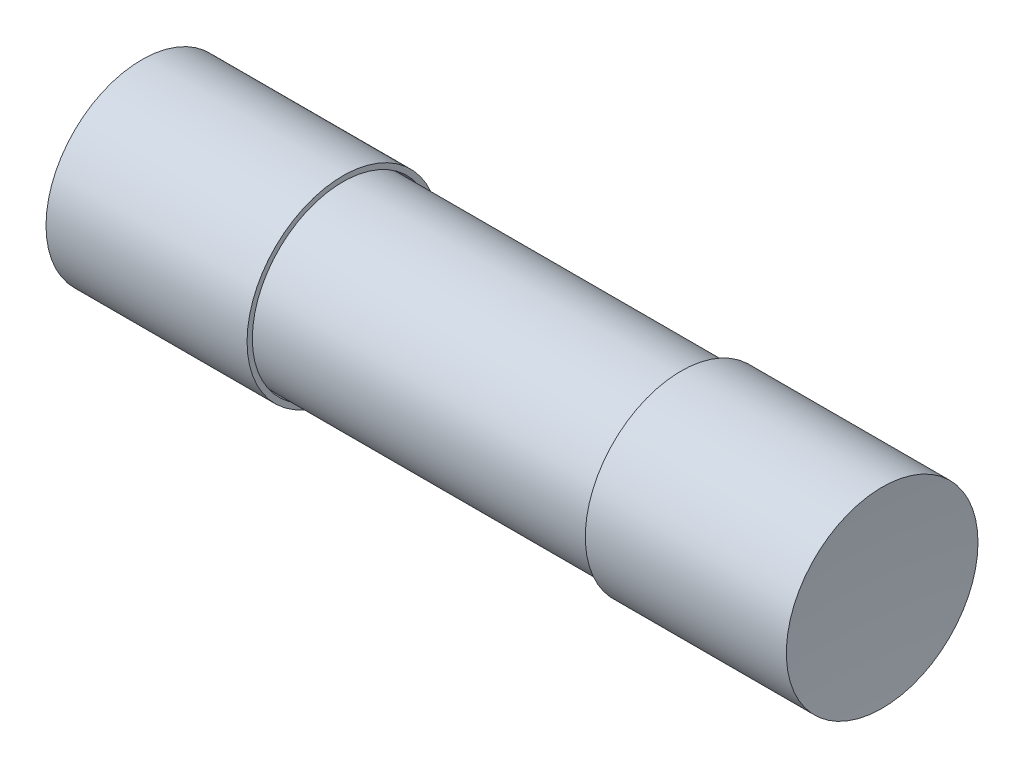
ISO-10303-21;
HEADER;
FILE_DESCRIPTION(('STEP AP214'),'2;1');
FILE_NAME('part.step','',(''),(''),'','','');
FILE_SCHEMA(('AUTOMOTIVE_DESIGN { 1 0 10303 214 1 1 1 1 }'));
ENDSEC;
DATA;
#1=APPLICATION_CONTEXT('core data for automotive mechanical design processes');
#2=APPLICATION_PROTOCOL_DEFINITION('international standard','automotive_design',2000,#1);
#3=PRODUCT_CONTEXT('',#1,'mechanical');
#4=PRODUCT('Part','Part','',(#3));
#5=PRODUCT_RELATED_PRODUCT_CATEGORY('part','',(#4));
#6=PRODUCT_DEFINITION_FORMATION('','',#4);
#7=PRODUCT_DEFINITION_CONTEXT('part definition',#1,'design');
#8=PRODUCT_DEFINITION('design','',#6,#7);
#9=PRODUCT_DEFINITION_SHAPE('','',#8);
#10=(LENGTH_UNIT() NAMED_UNIT(*) SI_UNIT(.MILLI.,.METRE.));
#11=(NAMED_UNIT(*) PLANE_ANGLE_UNIT() SI_UNIT($,.RADIAN.));
#12=(NAMED_UNIT(*) SI_UNIT($,.STERADIAN.) SOLID_ANGLE_UNIT());
#13=UNCERTAINTY_MEASURE_WITH_UNIT(LENGTH_MEASURE(1.E-05),#10,'distance_accuracy_value','');
#14=(GEOMETRIC_REPRESENTATION_CONTEXT(3) GLOBAL_UNCERTAINTY_ASSIGNED_CONTEXT((#13)) GLOBAL_UNIT_ASSIGNED_CONTEXT((#10,
#11,#12)) REPRESENTATION_CONTEXT('',''));
#15=CARTESIAN_POINT('',(0.,0.,0.));
#16=DIRECTION('',(0.,0.,1.));
#17=DIRECTION('',(1.,0.,0.));
#18=AXIS2_PLACEMENT_3D('',#15,#16,#17);
#19=CARTESIAN_POINT('',(-9.85,0.,0.));
#20=DIRECTION('',(1.,0.,0.));
#21=DIRECTION('',(0.,0.,-1.));
#22=AXIS2_PLACEMENT_3D('',#19,#20,#21);
#23=CYLINDRICAL_SURFACE('',#22,2.55);
#24=CARTESIAN_POINT('',(-9.85,0.,0.));
#25=DIRECTION('',(-1.,0.,0.));
#26=DIRECTION('',(0.,0.,1.));
#27=AXIS2_PLACEMENT_3D('',#24,#25,#26);
#28=CIRCLE('',#27,2.55);
#29=CARTESIAN_POINT('',(-9.85,0.,2.55));
#30=VERTEX_POINT('',#29);
#31=EDGE_CURVE('E11',#30,#30,#28,.T.);
#32=ORIENTED_EDGE('',*,*,#31,.F.);
#33=EDGE_LOOP('',(#32));
#34=FACE_BOUND('',#33,.T.);
#35=CARTESIAN_POINT('',(-4.5,0.,0.));
#36=DIRECTION('',(-1.,0.,0.));
#37=DIRECTION('',(0.,0.,1.));
#38=AXIS2_PLACEMENT_3D('',#35,#36,#37);
#39=CIRCLE('',#38,2.55);
#40=CARTESIAN_POINT('',(-4.5,0.,2.55));
#41=VERTEX_POINT('',#40);
#42=EDGE_CURVE('E53',#41,#41,#39,.T.);
#43=ORIENTED_EDGE('',*,*,#42,.T.);
#44=EDGE_LOOP('',(#43));
#45=FACE_BOUND('',#44,.T.);
#46=ADVANCED_FACE('F45',(#34,#45),#23,.T.);
#47=CARTESIAN_POINT('',(-42.3125000000002,0.,0.));
#48=DIRECTION('',(0.,0.,1.));
#49=DIRECTION('',(1.,0.,0.));
#50=AXIS2_PLACEMENT_3D('',#47,#48,#49);
#51=SPHERICAL_SURFACE('',#50,32.5625000000002);
#52=CARTESIAN_POINT('',(-42.3125000000002,0.,0.));
#53=DIRECTION('',(-1.,0.,0.));
#54=DIRECTION('',(0.,0.,1.));
#55=AXIS2_PLACEMENT_3D('',#52,#53,#54);
#56=SPHERICAL_SURFACE('',#55,32.5625000000002);
#57=ORIENTED_EDGE('',*,*,#31,.T.);
#58=EDGE_LOOP('',(#57));
#59=FACE_BOUND('',#58,.T.);
#60=ADVANCED_FACE('F47',(#59),#56,.F.);
#61=CARTESIAN_POINT('',(-4.5,0.,0.));
#62=DIRECTION('',(-1.,0.,0.));
#63=DIRECTION('',(0.,0.,1.));
#64=AXIS2_PLACEMENT_3D('',#61,#62,#63);
#65=PLANE('',#64);
#66=CARTESIAN_POINT('',(-4.5,0.,0.));
#67=DIRECTION('',(-1.,0.,0.));
#68=DIRECTION('',(0.,0.,1.));
#69=AXIS2_PLACEMENT_3D('',#66,#67,#68);
#70=CIRCLE('',#69,2.41);
#71=CARTESIAN_POINT('',(-4.5,0.,2.41));
#72=VERTEX_POINT('',#71);
#73=EDGE_CURVE('E64',#72,#72,#70,.T.);
#74=ORIENTED_EDGE('',*,*,#73,.T.);
#75=EDGE_LOOP('',(#74));
#76=FACE_BOUND('',#75,.T.);
#77=ORIENTED_EDGE('',*,*,#42,.F.);
#78=EDGE_LOOP('',(#77));
#79=FACE_BOUND('',#78,.T.);
#80=ADVANCED_FACE('F70',(#76,#79),#65,.F.);
#81=CARTESIAN_POINT('',(-9.85,0.,0.));
#82=DIRECTION('',(1.,0.,0.));
#83=DIRECTION('',(0.,0.,-1.));
#84=AXIS2_PLACEMENT_3D('',#81,#82,#83);
#85=CYLINDRICAL_SURFACE('',#84,2.41);
#86=CARTESIAN_POINT('',(-9.71,0.,0.));
#87=DIRECTION('',(-1.,0.,0.));
#88=DIRECTION('',(0.,0.,1.));
#89=AXIS2_PLACEMENT_3D('',#86,#87,#88);
#90=CIRCLE('',#89,2.41);
#91=CARTESIAN_POINT('',(-9.71,0.,2.41));
#92=VERTEX_POINT('',#91);
#93=EDGE_CURVE('E60',#92,#92,#90,.T.);
#94=ORIENTED_EDGE('',*,*,#93,.T.);
#95=EDGE_LOOP('',(#94));
#96=FACE_BOUND('',#95,.T.);
#97=ORIENTED_EDGE('',*,*,#73,.F.);
#98=EDGE_LOOP('',(#97));
#99=FACE_BOUND('',#98,.T.);
#100=ADVANCED_FACE('F73',(#96,#99),#85,.F.);
#101=CARTESIAN_POINT('',(-9.71,0.,0.));
#102=DIRECTION('',(-1.,0.,0.));
#103=DIRECTION('',(0.,0.,1.));
#104=AXIS2_PLACEMENT_3D('',#101,#102,#103);
#105=PLANE('',#104);
#106=ORIENTED_EDGE('',*,*,#93,.F.);
#107=EDGE_LOOP('',(#106));
#108=FACE_BOUND('',#107,.T.);
#109=ADVANCED_FACE('F75',(#108),#105,.F.);
#110=CLOSED_SHELL('',(#46,#60,#80,#100,#109));
#111=MANIFOLD_SOLID_BREP('B2',#110);
#112=CARTESIAN_POINT('',(9.85,0.,0.));
#113=DIRECTION('',(-1.,0.,0.));
#114=DIRECTION('',(0.,0.,1.));
#115=AXIS2_PLACEMENT_3D('',#112,#113,#114);
#116=CYLINDRICAL_SURFACE('',#115,2.55);
#117=CARTESIAN_POINT('',(9.85,0.,0.));
#118=DIRECTION('',(1.,0.,0.));
#119=DIRECTION('',(0.,0.,-1.));
#120=AXIS2_PLACEMENT_3D('',#117,#118,#119);
#121=CIRCLE('',#120,2.55);
#122=CARTESIAN_POINT('',(9.85,0.,-2.55));
#123=VERTEX_POINT('',#122);
#124=EDGE_CURVE('E44',#123,#123,#121,.T.);
#125=ORIENTED_EDGE('',*,*,#124,.F.);
#126=EDGE_LOOP('',(#125));
#127=FACE_BOUND('',#126,.T.);
#128=CARTESIAN_POINT('',(4.5,0.,0.));
#129=DIRECTION('',(1.,0.,0.));
#130=DIRECTION('',(0.,0.,-1.));
#131=AXIS2_PLACEMENT_3D('',#128,#129,#130);
#132=CIRCLE('',#131,2.55);
#133=CARTESIAN_POINT('',(4.5,0.,-2.55));
#134=VERTEX_POINT('',#133);
#135=EDGE_CURVE('E151',#134,#134,#132,.T.);
#136=ORIENTED_EDGE('',*,*,#135,.T.);
#137=EDGE_LOOP('',(#136));
#138=FACE_BOUND('',#137,.T.);
#139=ADVANCED_FACE('F143',(#127,#138),#116,.T.);
#140=CARTESIAN_POINT('',(42.3125000000002,0.,0.));
#141=DIRECTION('',(0.,0.,1.));
#142=DIRECTION('',(1.,0.,0.));
#143=AXIS2_PLACEMENT_3D('',#140,#141,#142);
#144=SPHERICAL_SURFACE('',#143,32.5625000000002);
#145=CARTESIAN_POINT('',(42.3125000000002,0.,0.));
#146=DIRECTION('',(1.,0.,0.));
#147=DIRECTION('',(0.,0.,-1.));
#148=AXIS2_PLACEMENT_3D('',#145,#146,#147);
#149=SPHERICAL_SURFACE('',#148,32.5625000000002);
#150=ORIENTED_EDGE('',*,*,#124,.T.);
#151=EDGE_LOOP('',(#150));
#152=FACE_BOUND('',#151,.T.);
#153=ADVANCED_FACE('F145',(#152),#149,.F.);
#154=CARTESIAN_POINT('',(4.5,0.,0.));
#155=DIRECTION('',(1.,0.,0.));
#156=DIRECTION('',(0.,0.,-1.));
#157=AXIS2_PLACEMENT_3D('',#154,#155,#156);
#158=PLANE('',#157);
#159=CARTESIAN_POINT('',(4.5,0.,0.));
#160=DIRECTION('',(1.,0.,0.));
#161=DIRECTION('',(0.,0.,-1.));
#162=AXIS2_PLACEMENT_3D('',#159,#160,#161);
#163=CIRCLE('',#162,2.41);
#164=CARTESIAN_POINT('',(4.5,0.,-2.41));
#165=VERTEX_POINT('',#164);
#166=EDGE_CURVE('E162',#165,#165,#163,.T.);
#167=ORIENTED_EDGE('',*,*,#166,.T.);
#168=EDGE_LOOP('',(#167));
#169=FACE_BOUND('',#168,.T.);
#170=ORIENTED_EDGE('',*,*,#135,.F.);
#171=EDGE_LOOP('',(#170));
#172=FACE_BOUND('',#171,.T.);
#173=ADVANCED_FACE('F168',(#169,#172),#158,.F.);
#174=CARTESIAN_POINT('',(9.85,0.,0.));
#175=DIRECTION('',(-1.,0.,0.));
#176=DIRECTION('',(0.,0.,1.));
#177=AXIS2_PLACEMENT_3D('',#174,#175,#176);
#178=CYLINDRICAL_SURFACE('',#177,2.41);
#179=CARTESIAN_POINT('',(9.71,0.,0.));
#180=DIRECTION('',(1.,0.,0.));
#181=DIRECTION('',(0.,0.,-1.));
#182=AXIS2_PLACEMENT_3D('',#179,#180,#181);
#183=CIRCLE('',#182,2.41);
#184=CARTESIAN_POINT('',(9.71,0.,-2.41));
#185=VERTEX_POINT('',#184);
#186=EDGE_CURVE('E158',#185,#185,#183,.T.);
#187=ORIENTED_EDGE('',*,*,#186,.T.);
#188=EDGE_LOOP('',(#187));
#189=FACE_BOUND('',#188,.T.);
#190=ORIENTED_EDGE('',*,*,#166,.F.);
#191=EDGE_LOOP('',(#190));
#192=FACE_BOUND('',#191,.T.);
#193=ADVANCED_FACE('F171',(#189,#192),#178,.F.);
#194=CARTESIAN_POINT('',(9.71,0.,0.));
#195=DIRECTION('',(1.,0.,0.));
#196=DIRECTION('',(0.,0.,-1.));
#197=AXIS2_PLACEMENT_3D('',#194,#195,#196);
#198=PLANE('',#197);
#199=ORIENTED_EDGE('',*,*,#186,.F.);
#200=EDGE_LOOP('',(#199));
#201=FACE_BOUND('',#200,.T.);
#202=ADVANCED_FACE('F173',(#201),#198,.F.);
#203=CLOSED_SHELL('',(#139,#153,#173,#193,#202));
#204=MANIFOLD_SOLID_BREP('B6',#203);
#205=CARTESIAN_POINT('',(-9.65,0.,0.));
#206=DIRECTION('',(1.,0.,0.));
#207=DIRECTION('',(0.,0.,-1.));
#208=AXIS2_PLACEMENT_3D('',#205,#206,#207);
#209=CYLINDRICAL_SURFACE('',#208,0.05);
#210=CARTESIAN_POINT('',(-9.65,0.,0.));
#211=DIRECTION('',(1.,0.,0.));
#212=DIRECTION('',(0.,0.,-1.));
#213=AXIS2_PLACEMENT_3D('',#210,#211,#212);
#214=CIRCLE('',#213,0.05);
#215=CARTESIAN_POINT('',(-9.65,0.,-0.05));
#216=VERTEX_POINT('',#215);
#217=EDGE_CURVE('E142',#216,#216,#214,.T.);
#218=ORIENTED_EDGE('',*,*,#217,.T.);
#219=EDGE_LOOP('',(#218));
#220=FACE_BOUND('',#219,.T.);
#221=CARTESIAN_POINT('',(9.65,0.,0.));
#222=DIRECTION('',(1.,0.,0.));
#223=DIRECTION('',(0.,0.,-1.));
#224=AXIS2_PLACEMENT_3D('',#221,#222,#223);
#225=CIRCLE('',#224,0.05);
#226=CARTESIAN_POINT('',(9.65,0.,-0.05));
#227=VERTEX_POINT('',#226);
#228=EDGE_CURVE('E245',#227,#227,#225,.T.);
#229=ORIENTED_EDGE('',*,*,#228,.F.);
#230=EDGE_LOOP('',(#229));
#231=FACE_BOUND('',#230,.T.);
#232=ADVANCED_FACE('F238',(#220,#231),#209,.T.);
#233=CARTESIAN_POINT('',(-9.65,0.,0.));
#234=DIRECTION('',(1.,0.,0.));
#235=DIRECTION('',(0.,0.,-1.));
#236=AXIS2_PLACEMENT_3D('',#233,#234,#235);
#237=PLANE('',#236);
#238=ORIENTED_EDGE('',*,*,#217,.F.);
#239=EDGE_LOOP('',(#238));
#240=FACE_BOUND('',#239,.T.);
#241=ADVANCED_FACE('F255',(#240),#237,.F.);
#242=CARTESIAN_POINT('',(9.65,0.,0.));
#243=DIRECTION('',(1.,0.,0.));
#244=DIRECTION('',(0.,0.,-1.));
#245=AXIS2_PLACEMENT_3D('',#242,#243,#244);
#246=PLANE('',#245);
#247=ORIENTED_EDGE('',*,*,#228,.T.);
#248=EDGE_LOOP('',(#247));
#249=FACE_BOUND('',#248,.T.);
#250=ADVANCED_FACE('F252',(#249),#246,.T.);
#251=CLOSED_SHELL('',(#232,#241,#250));
#252=MANIFOLD_SOLID_BREP('B39',#251);
#253=CARTESIAN_POINT('',(-9.75,0.,0.));
#254=DIRECTION('',(1.,0.,0.));
#255=DIRECTION('',(0.,0.,-1.));
#256=AXIS2_PLACEMENT_3D('',#253,#254,#255);
#257=CYLINDRICAL_SURFACE('',#256,2.375);
#258=CARTESIAN_POINT('',(-9.75,0.,0.));
#259=DIRECTION('',(1.,0.,0.));
#260=DIRECTION('',(0.,0.,-1.));
#261=AXIS2_PLACEMENT_3D('',#258,#259,#260);
#262=CIRCLE('',#261,2.375);
#263=CARTESIAN_POINT('',(-9.75,0.,-2.375));
#264=VERTEX_POINT('',#263);
#265=EDGE_CURVE('E237',#264,#264,#262,.T.);
#266=ORIENTED_EDGE('',*,*,#265,.T.);
#267=EDGE_LOOP('',(#266));
#268=FACE_BOUND('',#267,.T.);
#269=CARTESIAN_POINT('',(9.75,0.,0.));
#270=DIRECTION('',(1.,0.,0.));
#271=DIRECTION('',(0.,0.,-1.));
#272=AXIS2_PLACEMENT_3D('',#269,#270,#271);
#273=CIRCLE('',#272,2.375);
#274=CARTESIAN_POINT('',(9.75,0.,-2.375));
#275=VERTEX_POINT('',#274);
#276=EDGE_CURVE('E298',#275,#275,#273,.T.);
#277=ORIENTED_EDGE('',*,*,#276,.F.);
#278=EDGE_LOOP('',(#277));
#279=FACE_BOUND('',#278,.T.);
#280=ADVANCED_FACE('F291',(#268,#279),#257,.T.);
#281=CARTESIAN_POINT('',(-9.75,0.,0.));
#282=DIRECTION('',(1.,0.,0.));
#283=DIRECTION('',(0.,0.,-1.));
#284=AXIS2_PLACEMENT_3D('',#281,#282,#283);
#285=PLANE('',#284);
#286=CARTESIAN_POINT('',(-9.75,0.,0.));
#287=DIRECTION('',(1.,0.,0.));
#288=DIRECTION('',(0.,0.,-1.));
#289=AXIS2_PLACEMENT_3D('',#286,#287,#288);
#290=CIRCLE('',#289,2.175);
#291=CARTESIAN_POINT('',(-9.75,0.,-2.175));
#292=VERTEX_POINT('',#291);
#293=EDGE_CURVE('E305',#292,#292,#290,.T.);
#294=ORIENTED_EDGE('',*,*,#293,.T.);
#295=EDGE_LOOP('',(#294));
#296=FACE_BOUND('',#295,.T.);
#297=ORIENTED_EDGE('',*,*,#265,.F.);
#298=EDGE_LOOP('',(#297));
#299=FACE_BOUND('',#298,.T.);
#300=ADVANCED_FACE('F319',(#296,#299),#285,.F.);
#301=CARTESIAN_POINT('',(9.75,0.,0.));
#302=DIRECTION('',(1.,0.,0.));
#303=DIRECTION('',(0.,0.,-1.));
#304=AXIS2_PLACEMENT_3D('',#301,#302,#303);
#305=PLANE('',#304);
#306=CARTESIAN_POINT('',(9.75,0.,0.));
#307=DIRECTION('',(1.,0.,0.));
#308=DIRECTION('',(0.,0.,-1.));
#309=AXIS2_PLACEMENT_3D('',#306,#307,#308);
#310=CIRCLE('',#309,2.175);
#311=CARTESIAN_POINT('',(9.75,0.,-2.175));
#312=VERTEX_POINT('',#311);
#313=EDGE_CURVE('E309',#312,#312,#310,.T.);
#314=ORIENTED_EDGE('',*,*,#313,.F.);
#315=EDGE_LOOP('',(#314));
#316=FACE_BOUND('',#315,.T.);
#317=ORIENTED_EDGE('',*,*,#276,.T.);
#318=EDGE_LOOP('',(#317));
#319=FACE_BOUND('',#318,.T.);
#320=ADVANCED_FACE('F317',(#316,#319),#305,.T.);
#321=CARTESIAN_POINT('',(-9.75,0.,0.));
#322=DIRECTION('',(1.,0.,0.));
#323=DIRECTION('',(0.,0.,-1.));
#324=AXIS2_PLACEMENT_3D('',#321,#322,#323);
#325=CYLINDRICAL_SURFACE('',#324,2.175);
#326=ORIENTED_EDGE('',*,*,#293,.F.);
#327=EDGE_LOOP('',(#326));
#328=FACE_BOUND('',#327,.T.);
#329=ORIENTED_EDGE('',*,*,#313,.T.);
#330=EDGE_LOOP('',(#329));
#331=FACE_BOUND('',#330,.T.);
#332=ADVANCED_FACE('F315',(#328,#331),#325,.F.);
#333=CLOSED_SHELL('',(#280,#300,#320,#332));
#334=MANIFOLD_SOLID_BREP('B137',#333);
#335=ADVANCED_BREP_SHAPE_REPRESENTATION('',(#18,#111,#204,#252,#334),#14);
#336=SHAPE_DEFINITION_REPRESENTATION(#9,#335);
ENDSEC;
END-ISO-10303-21;
